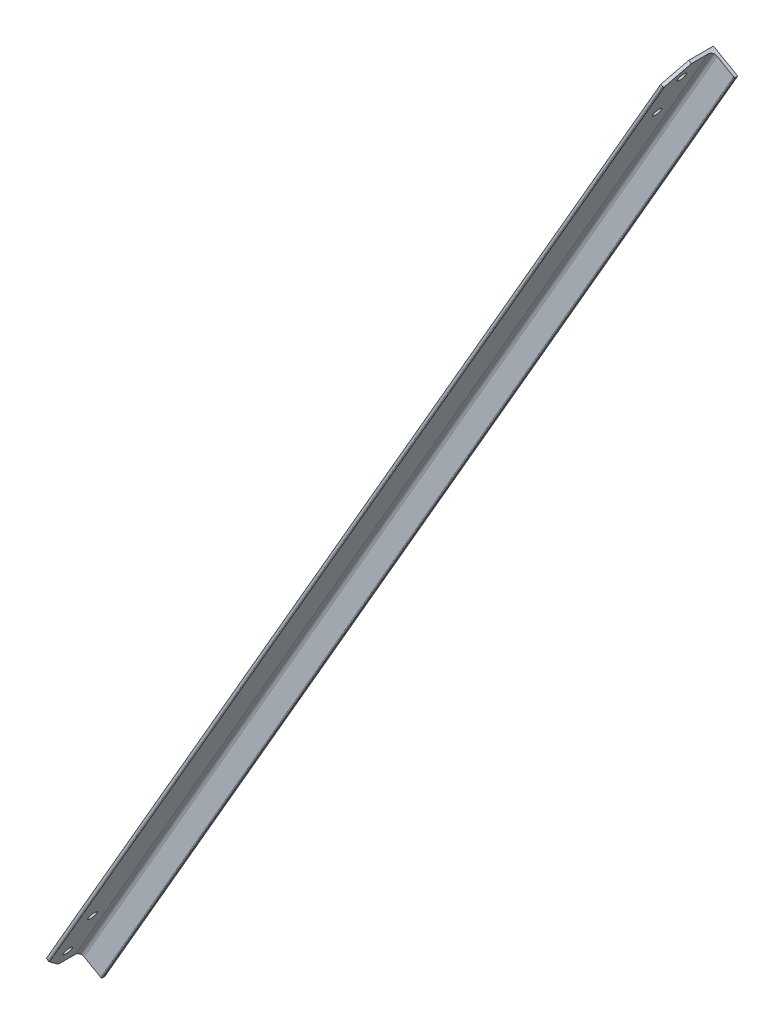
ISO-10303-21;
HEADER;
FILE_DESCRIPTION(('STEP AP214'),'2;1');
FILE_NAME('part.step','',(''),(''),'','','');
FILE_SCHEMA(('AUTOMOTIVE_DESIGN { 1 0 10303 214 1 1 1 1 }'));
ENDSEC;
DATA;
#1=APPLICATION_CONTEXT('core data for automotive mechanical design processes');
#2=APPLICATION_PROTOCOL_DEFINITION('international standard','automotive_design',2000,#1);
#3=PRODUCT_CONTEXT('',#1,'mechanical');
#4=PRODUCT('Part','Part','',(#3));
#5=PRODUCT_RELATED_PRODUCT_CATEGORY('part','',(#4));
#6=PRODUCT_DEFINITION_FORMATION('','',#4);
#7=PRODUCT_DEFINITION_CONTEXT('part definition',#1,'design');
#8=PRODUCT_DEFINITION('design','',#6,#7);
#9=PRODUCT_DEFINITION_SHAPE('','',#8);
#10=(LENGTH_UNIT() NAMED_UNIT(*) SI_UNIT(.MILLI.,.METRE.));
#11=(NAMED_UNIT(*) PLANE_ANGLE_UNIT() SI_UNIT($,.RADIAN.));
#12=(NAMED_UNIT(*) SI_UNIT($,.STERADIAN.) SOLID_ANGLE_UNIT());
#13=UNCERTAINTY_MEASURE_WITH_UNIT(LENGTH_MEASURE(1.E-05),#10,'distance_accuracy_value','');
#14=(GEOMETRIC_REPRESENTATION_CONTEXT(3) GLOBAL_UNCERTAINTY_ASSIGNED_CONTEXT((#13)) GLOBAL_UNIT_ASSIGNED_CONTEXT((#10,
#11,#12)) REPRESENTATION_CONTEXT('',''));
#15=CARTESIAN_POINT('',(0.,0.,0.));
#16=DIRECTION('',(0.,0.,1.));
#17=DIRECTION('',(1.,0.,0.));
#18=AXIS2_PLACEMENT_3D('',#15,#16,#17);
#19=CARTESIAN_POINT('',(2.88386459460233,-1.66499999999981,70.));
#20=DIRECTION('',(0.,0.,-1.));
#21=DIRECTION('',(-1.,0.,0.));
#22=AXIS2_PLACEMENT_3D('',#19,#20,#21);
#23=PLANE('',#22);
#24=DIRECTION('',(0.499999999999998,0.86602540378444,0.));
#25=VECTOR('',#24,1.);
#26=CARTESIAN_POINT('',(2.22044604925031E-13,2.22044604925031E-13,70.));
#27=LINE('',#26,#25);
#28=CARTESIAN_POINT('',(15.0000000000005,25.980762113534,70.));
#29=VERTEX_POINT('',#28);
#30=CARTESIAN_POINT('',(1005.,1740.71106160672,70.));
#31=VERTEX_POINT('',#30);
#32=EDGE_CURVE('E167',#29,#31,#27,.T.);
#33=ORIENTED_EDGE('',*,*,#32,.F.);
#34=DIRECTION('',(0.86602540378444,-0.499999999999998,0.));
#35=VECTOR('',#34,1.);
#36=CARTESIAN_POINT('',(17.8838645946026,24.315762113534,70.));
#37=LINE('',#36,#35);
#38=CARTESIAN_POINT('',(17.8838645946026,24.315762113534,70.));
#39=VERTEX_POINT('',#38);
#40=EDGE_CURVE('E88',#29,#39,#37,.T.);
#41=ORIENTED_EDGE('',*,*,#40,.T.);
#42=DIRECTION('',(0.499999999999998,0.86602540378444,0.));
#43=VECTOR('',#42,1.);
#44=CARTESIAN_POINT('',(2.88386459460233,-1.66499999999981,70.));
#45=LINE('',#44,#43);
#46=CARTESIAN_POINT('',(1007.8838645946,1739.04606160672,70.));
#47=VERTEX_POINT('',#46);
#48=EDGE_CURVE('E186',#39,#47,#45,.T.);
#49=ORIENTED_EDGE('',*,*,#48,.T.);
#50=DIRECTION('',(-0.86602540378444,0.499999999999998,0.));
#51=VECTOR('',#50,1.);
#52=CARTESIAN_POINT('',(1007.8838645946,1739.04606160673,70.));
#53=LINE('',#52,#51);
#54=EDGE_CURVE('E218',#47,#31,#53,.T.);
#55=ORIENTED_EDGE('',*,*,#54,.T.);
#56=EDGE_LOOP('',(#33,#41,#49,#55));
#57=FACE_BOUND('',#56,.T.);
#58=ADVANCED_FACE('F66',(#57),#23,.F.);
#59=CARTESIAN_POINT('',(2.22044604925031E-13,2.22044604925031E-13,70.));
#60=DIRECTION('',(0.86602540378444,-0.499999999999998,0.));
#61=DIRECTION('',(0.499999999999998,0.86602540378444,0.));
#62=AXIS2_PLACEMENT_3D('',#59,#60,#61);
#63=PLANE('',#62);
#64=CARTESIAN_POINT('',(964.999999999996,1671.42902930397,40.0047232344756));
#65=DIRECTION('',(-0.86602540378444,0.499999999999998,0.));
#66=DIRECTION('',(-0.499999999999998,-0.86602540378444,0.));
#67=AXIS2_PLACEMENT_3D('',#64,#65,#66);
#68=CIRCLE('',#67,7.00000000000007);
#69=CARTESIAN_POINT('',(961.499999999996,1665.36685147748,40.0047232344756));
#70=VERTEX_POINT('',#69);
#71=EDGE_CURVE('E456',#70,#70,#68,.T.);
#72=ORIENTED_EDGE('',*,*,#71,.F.);
#73=EDGE_LOOP('',(#72));
#74=FACE_BOUND('',#73,.T.);
#75=CARTESIAN_POINT('',(1005.,1740.71106160673,40.0047232344756));
#76=DIRECTION('',(-0.86602540378444,0.499999999999998,0.));
#77=DIRECTION('',(-0.499999999999998,-0.86602540378444,0.));
#78=AXIS2_PLACEMENT_3D('',#75,#76,#77);
#79=CIRCLE('',#78,6.99999999999985);
#80=CARTESIAN_POINT('',(1001.5,1734.64888378023,40.0047232344756));
#81=VERTEX_POINT('',#80);
#82=EDGE_CURVE('E457',#81,#81,#79,.T.);
#83=ORIENTED_EDGE('',*,*,#82,.F.);
#84=EDGE_LOOP('',(#83));
#85=FACE_BOUND('',#84,.T.);
#86=CARTESIAN_POINT('',(15.0000000000002,25.9807621135336,40.));
#87=DIRECTION('',(-0.86602540378444,0.499999999999998,0.));
#88=DIRECTION('',(-0.499999999999998,-0.86602540378444,0.));
#89=AXIS2_PLACEMENT_3D('',#86,#87,#88);
#90=CIRCLE('',#89,7.);
#91=CARTESIAN_POINT('',(11.5000000000002,19.9185842870425,40.));
#92=VERTEX_POINT('',#91);
#93=EDGE_CURVE('E445',#92,#92,#90,.T.);
#94=ORIENTED_EDGE('',*,*,#93,.F.);
#95=EDGE_LOOP('',(#94));
#96=FACE_BOUND('',#95,.T.);
#97=CARTESIAN_POINT('',(55.,95.2627944162888,40.));
#98=DIRECTION('',(-0.86602540378444,0.499999999999998,0.));
#99=DIRECTION('',(-0.499999999999998,-0.86602540378444,0.));
#100=AXIS2_PLACEMENT_3D('',#97,#98,#99);
#101=CIRCLE('',#100,7.);
#102=CARTESIAN_POINT('',(51.5,89.2006165897977,40.));
#103=VERTEX_POINT('',#102);
#104=EDGE_CURVE('E440',#103,#103,#101,.T.);
#105=ORIENTED_EDGE('',*,*,#104,.F.);
#106=EDGE_LOOP('',(#105));
#107=FACE_BOUND('',#106,.T.);
#108=DIRECTION('',(0.,0.,-1.));
#109=VECTOR('',#108,1.);
#110=CARTESIAN_POINT('',(2.22044604925031E-13,2.22044604925031E-13,70.));
#111=LINE('',#110,#109);
#112=CARTESIAN_POINT('',(2.22044604925031E-13,2.22044604925031E-13,39.9999999999995));
#113=VERTEX_POINT('',#112);
#114=CARTESIAN_POINT('',(2.22044604925031E-13,2.22044604925031E-13,0.));
#115=VERTEX_POINT('',#114);
#116=EDGE_CURVE('E148',#113,#115,#111,.T.);
#117=ORIENTED_EDGE('',*,*,#116,.F.);
#118=DIRECTION('',(0.353553390593273,0.612372435695797,0.707106781186546));
#119=VECTOR('',#118,1.);
#120=CARTESIAN_POINT('',(2.63677968348475E-13,2.98372437868011E-13,39.9999999999995));
#121=LINE('',#120,#119);
#122=EDGE_CURVE('E232',#113,#29,#121,.T.);
#123=ORIENTED_EDGE('',*,*,#122,.T.);
#124=ORIENTED_EDGE('',*,*,#32,.T.);
#125=DIRECTION('',(-0.353553390593269,-0.61237243569579,0.707106781186553));
#126=VECTOR('',#125,1.);
#127=CARTESIAN_POINT('',(1005.,1740.71106160673,70.));
#128=LINE('',#127,#126);
#129=CARTESIAN_POINT('',(1020.,1766.69182372026,40.));
#130=VERTEX_POINT('',#129);
#131=EDGE_CURVE('E221',#31,#130,#128,.F.);
#132=ORIENTED_EDGE('',*,*,#131,.T.);
#133=DIRECTION('',(0.,0.,-1.));
#134=VECTOR('',#133,1.);
#135=CARTESIAN_POINT('',(1020.,1766.69182372026,70.));
#136=LINE('',#135,#134);
#137=CARTESIAN_POINT('',(1020.,1766.69182372026,0.));
#138=VERTEX_POINT('',#137);
#139=EDGE_CURVE('E164',#130,#138,#136,.T.);
#140=ORIENTED_EDGE('',*,*,#139,.T.);
#141=DIRECTION('',(0.499999999999998,0.86602540378444,0.));
#142=VECTOR('',#141,1.);
#143=CARTESIAN_POINT('',(2.22044604925031E-13,2.22044604925031E-13,0.));
#144=LINE('',#143,#142);
#145=EDGE_CURVE('E161',#115,#138,#144,.T.);
#146=ORIENTED_EDGE('',*,*,#145,.F.);
#147=EDGE_LOOP('',(#117,#123,#124,#132,#140,#146));
#148=FACE_BOUND('',#147,.T.);
#149=ADVANCED_FACE('F162',(#74,#85,#96,#107,#148),#63,.F.);
#150=CARTESIAN_POINT('',(2.22044604925031E-13,2.22044604925031E-13,0.));
#151=DIRECTION('',(0.,0.,1.));
#152=DIRECTION('',(1.,0.,0.));
#153=AXIS2_PLACEMENT_3D('',#150,#151,#152);
#154=PLANE('',#153);
#155=DIRECTION('',(0.866025403784439,-0.5,0.));
#156=VECTOR('',#155,1.);
#157=CARTESIAN_POINT('',(1020.,1766.69182372026,0.));
#158=LINE('',#157,#156);
#159=CARTESIAN_POINT('',(1058.9711431703,1744.19182372026,0.));
#160=VERTEX_POINT('',#159);
#161=EDGE_CURVE('E188',#138,#160,#158,.T.);
#162=ORIENTED_EDGE('',*,*,#161,.T.);
#163=DIRECTION('',(0.499999999999998,0.86602540378444,0.));
#164=VECTOR('',#163,1.);
#165=CARTESIAN_POINT('',(38.9711431702999,-22.4999999999997,0.));
#166=LINE('',#165,#164);
#167=CARTESIAN_POINT('',(38.9711431702999,-22.4999999999997,0.));
#168=VERTEX_POINT('',#167);
#169=EDGE_CURVE('E168',#168,#160,#166,.T.);
#170=ORIENTED_EDGE('',*,*,#169,.F.);
#171=DIRECTION('',(0.866025403784439,-0.5,0.));
#172=VECTOR('',#171,1.);
#173=CARTESIAN_POINT('',(2.22044604925031E-13,2.22044604925031E-13,0.));
#174=LINE('',#173,#172);
#175=EDGE_CURVE('E153',#115,#168,#174,.T.);
#176=ORIENTED_EDGE('',*,*,#175,.F.);
#177=ORIENTED_EDGE('',*,*,#145,.T.);
#178=EDGE_LOOP('',(#162,#170,#176,#177));
#179=FACE_BOUND('',#178,.T.);
#180=ADVANCED_FACE('F170',(#179),#154,.F.);
#181=CARTESIAN_POINT('',(38.9711431702999,-22.4999999999997,0.));
#182=DIRECTION('',(-0.86602540378444,0.499999999999998,0.));
#183=DIRECTION('',(-0.499999999999998,-0.86602540378444,0.));
#184=AXIS2_PLACEMENT_3D('',#181,#182,#183);
#185=PLANE('',#184);
#186=DIRECTION('',(0.,0.,1.));
#187=VECTOR('',#186,1.);
#188=CARTESIAN_POINT('',(1058.9711431703,1744.19182372026,0.));
#189=LINE('',#188,#187);
#190=CARTESIAN_POINT('',(1058.9711431703,1744.19182372026,3.33));
#191=VERTEX_POINT('',#190);
#192=EDGE_CURVE('E191',#160,#191,#189,.T.);
#193=ORIENTED_EDGE('',*,*,#192,.T.);
#194=DIRECTION('',(0.499999999999998,0.86602540378444,0.));
#195=VECTOR('',#194,1.);
#196=CARTESIAN_POINT('',(38.9711431702999,-22.4999999999997,3.33));
#197=LINE('',#196,#195);
#198=CARTESIAN_POINT('',(38.9711431702999,-22.4999999999997,3.33));
#199=VERTEX_POINT('',#198);
#200=EDGE_CURVE('E213',#199,#191,#197,.T.);
#201=ORIENTED_EDGE('',*,*,#200,.F.);
#202=DIRECTION('',(0.,0.,1.));
#203=VECTOR('',#202,1.);
#204=CARTESIAN_POINT('',(38.9711431702999,-22.4999999999997,0.));
#205=LINE('',#204,#203);
#206=EDGE_CURVE('E173',#168,#199,#205,.T.);
#207=ORIENTED_EDGE('',*,*,#206,.F.);
#208=ORIENTED_EDGE('',*,*,#169,.T.);
#209=EDGE_LOOP('',(#193,#201,#207,#208));
#210=FACE_BOUND('',#209,.T.);
#211=ADVANCED_FACE('F383',(#210),#185,.F.);
#212=CARTESIAN_POINT('',(37.52488074598,-21.6649999999996,3.33));
#213=DIRECTION('',(0.499999999999998,0.86602540378444,0.));
#214=DIRECTION('',(-0.86602540378444,0.499999999999998,0.));
#215=AXIS2_PLACEMENT_3D('',#212,#213,#214);
#216=CYLINDRICAL_SURFACE('',#215,1.66999999999998);
#217=CARTESIAN_POINT('',(1057.52488074598,1745.02682372026,3.33));
#218=DIRECTION('',(-0.499999999999998,-0.86602540378444,0.));
#219=DIRECTION('',(0.86602540378444,-0.499999999999998,0.));
#220=AXIS2_PLACEMENT_3D('',#217,#218,#219);
#221=CIRCLE('',#220,1.66999999999998);
#222=CARTESIAN_POINT('',(1057.52488074598,1745.02682372026,4.99999999999998));
#223=VERTEX_POINT('',#222);
#224=EDGE_CURVE('E193',#191,#223,#221,.T.);
#225=ORIENTED_EDGE('',*,*,#224,.T.);
#226=DIRECTION('',(0.499999999999998,0.86602540378444,0.));
#227=VECTOR('',#226,1.);
#228=CARTESIAN_POINT('',(37.52488074598,-21.6649999999996,4.99999999999998));
#229=LINE('',#228,#227);
#230=CARTESIAN_POINT('',(37.52488074598,-21.6649999999996,4.99999999999998));
#231=VERTEX_POINT('',#230);
#232=EDGE_CURVE('E210',#231,#223,#229,.T.);
#233=ORIENTED_EDGE('',*,*,#232,.F.);
#234=CARTESIAN_POINT('',(37.52488074598,-21.6649999999996,3.33));
#235=DIRECTION('',(-0.499999999999998,-0.86602540378444,0.));
#236=DIRECTION('',(0.86602540378444,-0.499999999999998,0.));
#237=AXIS2_PLACEMENT_3D('',#234,#235,#236);
#238=CIRCLE('',#237,1.66999999999998);
#239=EDGE_CURVE('E175',#199,#231,#238,.T.);
#240=ORIENTED_EDGE('',*,*,#239,.F.);
#241=ORIENTED_EDGE('',*,*,#200,.T.);
#242=EDGE_LOOP('',(#225,#233,#240,#241));
#243=FACE_BOUND('',#242,.T.);
#244=ADVANCED_FACE('F391',(#243),#216,.T.);
#245=CARTESIAN_POINT('',(37.52488074598,-21.6649999999996,5.));
#246=DIRECTION('',(0.,0.,-1.));
#247=DIRECTION('',(-1.,0.,0.));
#248=AXIS2_PLACEMENT_3D('',#245,#246,#247);
#249=PLANE('',#248);
#250=DIRECTION('',(-0.866025403784444,0.499999999999991,0.));
#251=VECTOR('',#250,1.);
#252=CARTESIAN_POINT('',(1057.52488074598,1745.02682372026,5.));
#253=LINE('',#252,#251);
#254=CARTESIAN_POINT('',(1030.8253175473,1760.44182372026,5.));
#255=VERTEX_POINT('',#254);
#256=EDGE_CURVE('E195',#223,#255,#253,.T.);
#257=ORIENTED_EDGE('',*,*,#256,.T.);
#258=DIRECTION('',(0.499999999999998,0.86602540378444,0.));
#259=VECTOR('',#258,1.);
#260=CARTESIAN_POINT('',(10.8253175473056,-6.24999999999987,5.));
#261=LINE('',#260,#259);
#262=CARTESIAN_POINT('',(10.8253175473056,-6.24999999999987,5.));
#263=VERTEX_POINT('',#262);
#264=EDGE_CURVE('E207',#263,#255,#261,.T.);
#265=ORIENTED_EDGE('',*,*,#264,.F.);
#266=DIRECTION('',(-0.866025403784444,0.499999999999991,0.));
#267=VECTOR('',#266,1.);
#268=CARTESIAN_POINT('',(37.52488074598,-21.6649999999996,5.));
#269=LINE('',#268,#267);
#270=EDGE_CURVE('E180',#231,#263,#269,.T.);
#271=ORIENTED_EDGE('',*,*,#270,.F.);
#272=ORIENTED_EDGE('',*,*,#232,.T.);
#273=EDGE_LOOP('',(#257,#265,#271,#272));
#274=FACE_BOUND('',#273,.T.);
#275=ADVANCED_FACE('F401',(#274),#249,.F.);
#276=CARTESIAN_POINT('',(10.8253175473056,-6.24999999999964,12.5));
#277=DIRECTION('',(0.499999999999998,0.86602540378444,0.));
#278=DIRECTION('',(-0.86602540378444,0.499999999999998,0.));
#279=AXIS2_PLACEMENT_3D('',#276,#277,#278);
#280=CYLINDRICAL_SURFACE('',#279,7.49999999999995);
#281=CARTESIAN_POINT('',(1030.8253175473,1760.44182372026,12.5));
#282=DIRECTION('',(0.499999999999998,0.86602540378444,0.));
#283=DIRECTION('',(-0.86602540378444,0.499999999999998,0.));
#284=AXIS2_PLACEMENT_3D('',#281,#282,#283);
#285=CIRCLE('',#284,7.49999999999995);
#286=CARTESIAN_POINT('',(1024.33012701892,1764.19182372026,12.5));
#287=VERTEX_POINT('',#286);
#288=EDGE_CURVE('E197',#255,#287,#285,.T.);
#289=ORIENTED_EDGE('',*,*,#288,.T.);
#290=DIRECTION('',(0.499999999999998,0.86602540378444,0.));
#291=VECTOR('',#290,1.);
#292=CARTESIAN_POINT('',(4.33012701892244,-2.49999999999972,12.5));
#293=LINE('',#292,#291);
#294=CARTESIAN_POINT('',(4.33012701892244,-2.49999999999972,12.5));
#295=VERTEX_POINT('',#294);
#296=EDGE_CURVE('E204',#295,#287,#293,.T.);
#297=ORIENTED_EDGE('',*,*,#296,.F.);
#298=CARTESIAN_POINT('',(10.8253175473056,-6.24999999999964,12.5));
#299=DIRECTION('',(0.499999999999998,0.86602540378444,0.));
#300=DIRECTION('',(-0.86602540378444,0.499999999999998,0.));
#301=AXIS2_PLACEMENT_3D('',#298,#299,#300);
#302=CIRCLE('',#301,7.49999999999995);
#303=EDGE_CURVE('E182',#263,#295,#302,.T.);
#304=ORIENTED_EDGE('',*,*,#303,.F.);
#305=ORIENTED_EDGE('',*,*,#264,.T.);
#306=EDGE_LOOP('',(#289,#297,#304,#305));
#307=FACE_BOUND('',#306,.T.);
#308=ADVANCED_FACE('F246',(#307),#280,.F.);
#309=CARTESIAN_POINT('',(4.33012701892244,-2.49999999999972,12.5));
#310=DIRECTION('',(-0.86602540378444,0.499999999999998,0.));
#311=DIRECTION('',(-0.499999999999998,-0.86602540378444,0.));
#312=AXIS2_PLACEMENT_3D('',#309,#310,#311);
#313=PLANE('',#312);
#314=CARTESIAN_POINT('',(969.330127018919,1668.92902930397,40.0047232344756));
#315=DIRECTION('',(-0.86602540378444,0.499999999999998,0.));
#316=DIRECTION('',(-0.499999999999998,-0.86602540378444,0.));
#317=AXIS2_PLACEMENT_3D('',#314,#315,#316);
#318=CIRCLE('',#317,7.00000000000007);
#319=CARTESIAN_POINT('',(965.830127018919,1662.86685147748,40.0047232344756));
#320=VERTEX_POINT('',#319);
#321=EDGE_CURVE('E448',#320,#320,#318,.F.);
#322=ORIENTED_EDGE('',*,*,#321,.F.);
#323=EDGE_LOOP('',(#322));
#324=FACE_BOUND('',#323,.T.);
#325=CARTESIAN_POINT('',(1009.33012701892,1738.21106160673,40.0047232344756));
#326=DIRECTION('',(-0.86602540378444,0.499999999999998,0.));
#327=DIRECTION('',(-0.499999999999998,-0.86602540378444,0.));
#328=AXIS2_PLACEMENT_3D('',#325,#326,#327);
#329=CIRCLE('',#328,6.99999999999985);
#330=CARTESIAN_POINT('',(1005.83012701892,1732.14888378023,40.0047232344756));
#331=VERTEX_POINT('',#330);
#332=EDGE_CURVE('E453',#331,#331,#329,.F.);
#333=ORIENTED_EDGE('',*,*,#332,.F.);
#334=EDGE_LOOP('',(#333));
#335=FACE_BOUND('',#334,.T.);
#336=CARTESIAN_POINT('',(19.3301270189225,23.4807621135336,40.));
#337=DIRECTION('',(-0.86602540378444,0.499999999999998,0.));
#338=DIRECTION('',(-0.499999999999998,-0.86602540378444,0.));
#339=AXIS2_PLACEMENT_3D('',#336,#337,#338);
#340=CIRCLE('',#339,7.);
#341=CARTESIAN_POINT('',(15.8301270189225,17.4185842870425,40.));
#342=VERTEX_POINT('',#341);
#343=EDGE_CURVE('E189',#342,#342,#340,.F.);
#344=ORIENTED_EDGE('',*,*,#343,.F.);
#345=EDGE_LOOP('',(#344));
#346=FACE_BOUND('',#345,.T.);
#347=CARTESIAN_POINT('',(59.3301270189223,92.7627944162889,40.));
#348=DIRECTION('',(-0.86602540378444,0.499999999999998,0.));
#349=DIRECTION('',(-0.499999999999998,-0.86602540378444,0.));
#350=AXIS2_PLACEMENT_3D('',#347,#348,#349);
#351=CIRCLE('',#350,7.);
#352=CARTESIAN_POINT('',(55.8301270189223,86.7006165897978,40.));
#353=VERTEX_POINT('',#352);
#354=EDGE_CURVE('E443',#353,#353,#351,.F.);
#355=ORIENTED_EDGE('',*,*,#354,.F.);
#356=EDGE_LOOP('',(#355));
#357=FACE_BOUND('',#356,.T.);
#358=DIRECTION('',(0.499999999999998,0.86602540378444,0.));
#359=VECTOR('',#358,1.);
#360=CARTESIAN_POINT('',(4.33012701892244,-2.49999999999972,68.33));
#361=LINE('',#360,#359);
#362=CARTESIAN_POINT('',(18.4951270189227,22.034499689214,68.33));
#363=VERTEX_POINT('',#362);
#364=CARTESIAN_POINT('',(1010.16512701892,1739.65732403104,68.33));
#365=VERTEX_POINT('',#364);
#366=EDGE_CURVE('E202',#363,#365,#361,.T.);
#367=ORIENTED_EDGE('',*,*,#366,.F.);
#368=DIRECTION('',(-0.353553390593273,-0.612372435695797,-0.707106781186546));
#369=VECTOR('',#368,1.);
#370=CARTESIAN_POINT('',(4.33012701892246,-2.49999999999969,39.9999999999995));
#371=LINE('',#370,#369);
#372=CARTESIAN_POINT('',(4.33012701892244,-2.49999999999972,39.9999999999995));
#373=VERTEX_POINT('',#372);
#374=EDGE_CURVE('E13',#363,#373,#371,.T.);
#375=ORIENTED_EDGE('',*,*,#374,.T.);
#376=DIRECTION('',(0.,0.,1.));
#377=VECTOR('',#376,1.);
#378=CARTESIAN_POINT('',(4.33012701892244,-2.49999999999972,12.5));
#379=LINE('',#378,#377);
#380=EDGE_CURVE('E184',#295,#373,#379,.T.);
#381=ORIENTED_EDGE('',*,*,#380,.F.);
#382=ORIENTED_EDGE('',*,*,#296,.T.);
#383=DIRECTION('',(0.,0.,1.));
#384=VECTOR('',#383,1.);
#385=CARTESIAN_POINT('',(1024.33012701892,1764.19182372026,12.5));
#386=LINE('',#385,#384);
#387=CARTESIAN_POINT('',(1024.33012701892,1764.19182372026,40.));
#388=VERTEX_POINT('',#387);
#389=EDGE_CURVE('E158',#287,#388,#386,.T.);
#390=ORIENTED_EDGE('',*,*,#389,.T.);
#391=DIRECTION('',(0.353553390593269,0.61237243569579,-0.707106781186553));
#392=VECTOR('',#391,1.);
#393=CARTESIAN_POINT('',(1009.33012701892,1738.21106160673,70.));
#394=LINE('',#393,#392);
#395=EDGE_CURVE('E225',#388,#365,#394,.F.);
#396=ORIENTED_EDGE('',*,*,#395,.T.);
#397=EDGE_LOOP('',(#367,#375,#381,#382,#390,#396));
#398=FACE_BOUND('',#397,.T.);
#399=ADVANCED_FACE('F240',(#324,#335,#346,#357,#398),#313,.F.);
#400=CARTESIAN_POINT('',(2.88386459460233,-1.66499999999981,68.33));
#401=DIRECTION('',(0.499999999999998,0.86602540378444,0.));
#402=DIRECTION('',(-0.86602540378444,0.499999999999998,0.));
#403=AXIS2_PLACEMENT_3D('',#400,#401,#402);
#404=CYLINDRICAL_SURFACE('',#403,1.67000000000002);
#405=ORIENTED_EDGE('',*,*,#48,.F.);
#406=CARTESIAN_POINT('',(17.0488645946026,22.869499689214,68.33));
#407=DIRECTION('',(-0.353553390593272,-0.612372435695794,0.707106781186549));
#408=DIRECTION('',(0.353553390593273,0.612372435695797,0.707106781186546));
#409=AXIS2_PLACEMENT_3D('',#406,#407,#408);
#410=ELLIPSE('',#409,2.36173664916311,1.67000000000002);
#411=EDGE_CURVE('E74',#39,#363,#410,.F.);
#412=ORIENTED_EDGE('',*,*,#411,.T.);
#413=ORIENTED_EDGE('',*,*,#366,.T.);
#414=CARTESIAN_POINT('',(1008.7188645946,1740.49232403105,68.33));
#415=DIRECTION('',(-0.353553390593275,-0.612372435695801,-0.707106781186542));
#416=DIRECTION('',(0.353553390593269,0.61237243569579,-0.707106781186553));
#417=AXIS2_PLACEMENT_3D('',#414,#415,#416);
#418=ELLIPSE('',#417,2.36173664916308,1.67000000000002);
#419=EDGE_CURVE('E228',#365,#47,#418,.T.);
#420=ORIENTED_EDGE('',*,*,#419,.T.);
#421=EDGE_LOOP('',(#405,#412,#413,#420));
#422=FACE_BOUND('',#421,.T.);
#423=ADVANCED_FACE('F257',(#422),#404,.T.);
#424=CARTESIAN_POINT('',(37.52488074598,-21.6649999999996,3.33));
#425=DIRECTION('',(-0.499999999999998,-0.86602540378444,0.));
#426=DIRECTION('',(0.86602540378444,-0.499999999999998,0.));
#427=AXIS2_PLACEMENT_3D('',#424,#425,#426);
#428=PLANE('',#427);
#429=ORIENTED_EDGE('',*,*,#380,.T.);
#430=DIRECTION('',(-0.86602540378444,0.499999999999998,0.));
#431=VECTOR('',#430,1.);
#432=CARTESIAN_POINT('',(2.68882138776405E-13,2.94438173161578E-13,39.9999999999995));
#433=LINE('',#432,#431);
#434=EDGE_CURVE('E156',#373,#113,#433,.T.);
#435=ORIENTED_EDGE('',*,*,#434,.T.);
#436=ORIENTED_EDGE('',*,*,#116,.T.);
#437=ORIENTED_EDGE('',*,*,#175,.T.);
#438=ORIENTED_EDGE('',*,*,#206,.T.);
#439=ORIENTED_EDGE('',*,*,#239,.T.);
#440=ORIENTED_EDGE('',*,*,#270,.T.);
#441=ORIENTED_EDGE('',*,*,#303,.T.);
#442=EDGE_LOOP('',(#429,#435,#436,#437,#438,#439,#440,#441));
#443=FACE_BOUND('',#442,.T.);
#444=ADVANCED_FACE('F151',(#443),#428,.T.);
#445=CARTESIAN_POINT('',(1057.52488074598,1745.02682372026,3.33));
#446=DIRECTION('',(-0.499999999999998,-0.86602540378444,0.));
#447=DIRECTION('',(0.86602540378444,-0.499999999999998,0.));
#448=AXIS2_PLACEMENT_3D('',#445,#446,#447);
#449=PLANE('',#448);
#450=ORIENTED_EDGE('',*,*,#139,.F.);
#451=DIRECTION('',(0.86602540378444,-0.499999999999998,0.));
#452=VECTOR('',#451,1.);
#453=CARTESIAN_POINT('',(1057.52488074598,1745.02682372026,40.));
#454=LINE('',#453,#452);
#455=EDGE_CURVE('E223',#130,#388,#454,.T.);
#456=ORIENTED_EDGE('',*,*,#455,.T.);
#457=ORIENTED_EDGE('',*,*,#389,.F.);
#458=ORIENTED_EDGE('',*,*,#288,.F.);
#459=ORIENTED_EDGE('',*,*,#256,.F.);
#460=ORIENTED_EDGE('',*,*,#224,.F.);
#461=ORIENTED_EDGE('',*,*,#192,.F.);
#462=ORIENTED_EDGE('',*,*,#161,.F.);
#463=EDGE_LOOP('',(#450,#456,#457,#458,#459,#460,#461,#462));
#464=FACE_BOUND('',#463,.T.);
#465=ADVANCED_FACE('F251',(#464),#449,.F.);
#466=CARTESIAN_POINT('',(858.972326183001,-368.910844526474,40.));
#467=DIRECTION('',(-0.86602540378444,0.499999999999998,0.));
#468=DIRECTION('',(-0.499999999999998,-0.86602540378444,0.));
#469=AXIS2_PLACEMENT_3D('',#466,#467,#468);
#470=CYLINDRICAL_SURFACE('',#469,7.);
#471=ORIENTED_EDGE('',*,*,#104,.T.);
#472=EDGE_LOOP('',(#471));
#473=FACE_BOUND('',#472,.T.);
#474=ORIENTED_EDGE('',*,*,#354,.T.);
#475=EDGE_LOOP('',(#474));
#476=FACE_BOUND('',#475,.T.);
#477=ADVANCED_FACE('F296',(#473,#476),#470,.F.);
#478=CARTESIAN_POINT('',(818.972326183001,-438.192876829229,40.));
#479=DIRECTION('',(-0.86602540378444,0.499999999999998,0.));
#480=DIRECTION('',(-0.499999999999998,-0.86602540378444,0.));
#481=AXIS2_PLACEMENT_3D('',#478,#479,#480);
#482=CYLINDRICAL_SURFACE('',#481,7.);
#483=ORIENTED_EDGE('',*,*,#93,.T.);
#484=EDGE_LOOP('',(#483));
#485=FACE_BOUND('',#484,.T.);
#486=ORIENTED_EDGE('',*,*,#343,.T.);
#487=EDGE_LOOP('',(#486));
#488=FACE_BOUND('',#487,.T.);
#489=ADVANCED_FACE('F288',(#485,#488),#482,.F.);
#490=CARTESIAN_POINT('',(1808.972326183,1276.53742266396,40.0047232344756));
#491=DIRECTION('',(-0.86602540378444,0.499999999999998,0.));
#492=DIRECTION('',(-0.499999999999998,-0.86602540378444,0.));
#493=AXIS2_PLACEMENT_3D('',#490,#491,#492);
#494=CYLINDRICAL_SURFACE('',#493,6.99999999999985);
#495=ORIENTED_EDGE('',*,*,#82,.T.);
#496=EDGE_LOOP('',(#495));
#497=FACE_BOUND('',#496,.T.);
#498=ORIENTED_EDGE('',*,*,#332,.T.);
#499=EDGE_LOOP('',(#498));
#500=FACE_BOUND('',#499,.T.);
#501=ADVANCED_FACE('F282',(#497,#500),#494,.F.);
#502=CARTESIAN_POINT('',(1768.972326183,1207.25539036121,40.0047232344756));
#503=DIRECTION('',(-0.86602540378444,0.499999999999998,0.));
#504=DIRECTION('',(-0.499999999999998,-0.86602540378444,0.));
#505=AXIS2_PLACEMENT_3D('',#502,#503,#504);
#506=CYLINDRICAL_SURFACE('',#505,7.00000000000007);
#507=ORIENTED_EDGE('',*,*,#71,.T.);
#508=EDGE_LOOP('',(#507));
#509=FACE_BOUND('',#508,.T.);
#510=ORIENTED_EDGE('',*,*,#321,.T.);
#511=EDGE_LOOP('',(#510));
#512=FACE_BOUND('',#511,.T.);
#513=ADVANCED_FACE('F277',(#509,#512),#506,.F.);
#514=CARTESIAN_POINT('',(1007.8838645946,1739.04606160673,70.));
#515=DIRECTION('',(-0.353553390593275,-0.612372435695801,-0.707106781186542));
#516=DIRECTION('',(-0.86602540378444,0.499999999999998,0.));
#517=AXIS2_PLACEMENT_3D('',#514,#515,#516);
#518=PLANE('',#517);
#519=ORIENTED_EDGE('',*,*,#395,.F.);
#520=ORIENTED_EDGE('',*,*,#455,.F.);
#521=ORIENTED_EDGE('',*,*,#131,.F.);
#522=ORIENTED_EDGE('',*,*,#54,.F.);
#523=ORIENTED_EDGE('',*,*,#419,.F.);
#524=EDGE_LOOP('',(#519,#520,#521,#522,#523));
#525=FACE_BOUND('',#524,.T.);
#526=ADVANCED_FACE('F255',(#525),#518,.F.);
#527=CARTESIAN_POINT('',(37.52488074598,-21.6649999999996,39.9999999999995));
#528=DIRECTION('',(-0.353553390593272,-0.612372435695794,0.707106781186549));
#529=DIRECTION('',(0.86602540378444,-0.499999999999998,0.));
#530=AXIS2_PLACEMENT_3D('',#527,#528,#529);
#531=PLANE('',#530);
#532=ORIENTED_EDGE('',*,*,#411,.F.);
#533=ORIENTED_EDGE('',*,*,#40,.F.);
#534=ORIENTED_EDGE('',*,*,#122,.F.);
#535=ORIENTED_EDGE('',*,*,#434,.F.);
#536=ORIENTED_EDGE('',*,*,#374,.F.);
#537=EDGE_LOOP('',(#532,#533,#534,#535,#536));
#538=FACE_BOUND('',#537,.T.);
#539=ADVANCED_FACE('F68',(#538),#531,.T.);
#540=CLOSED_SHELL('',(#58,#149,#180,#211,#244,#275,#308,#399,#423,#444,#465,#477,#489,#501,#513,
#526,#539));
#541=MANIFOLD_SOLID_BREP('B2',#540);
#542=ADVANCED_BREP_SHAPE_REPRESENTATION('',(#18,#541),#14);
#543=SHAPE_DEFINITION_REPRESENTATION(#9,#542);
ENDSEC;
END-ISO-10303-21;
